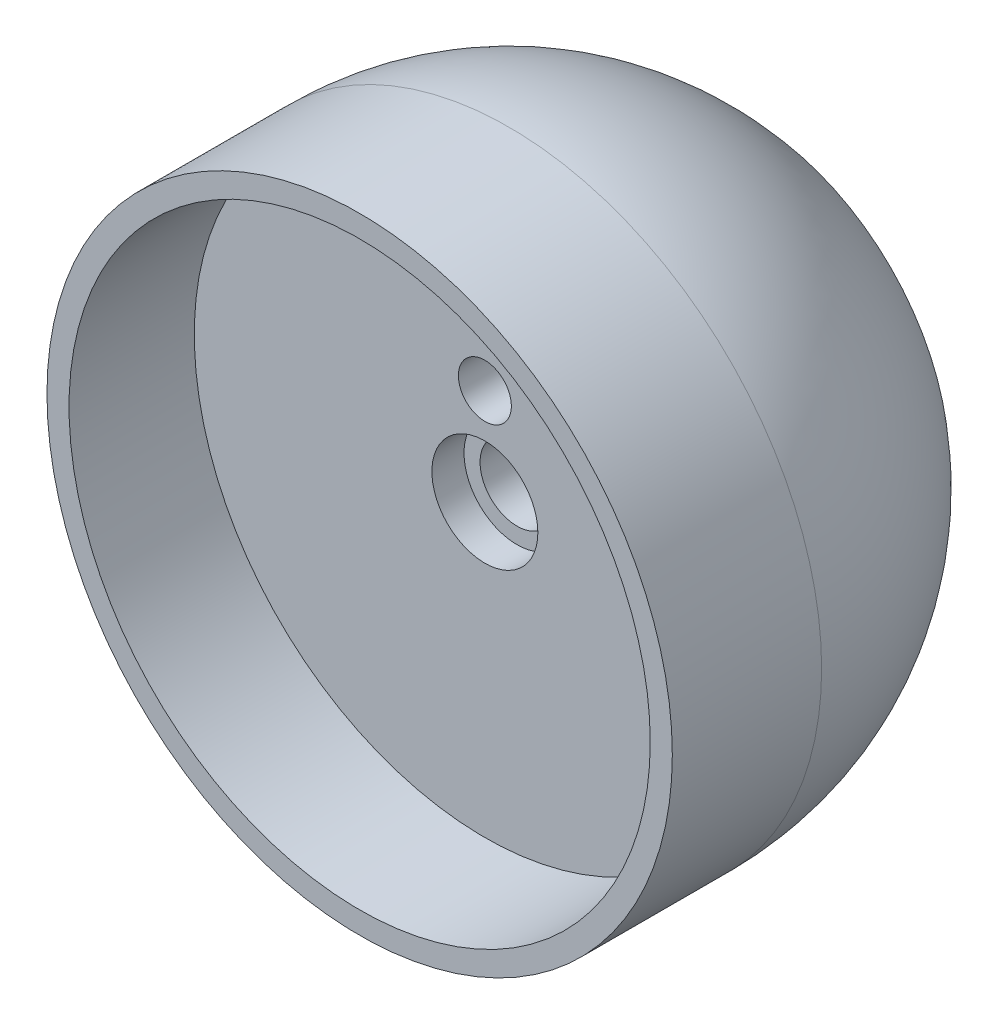
ISO-10303-21;
HEADER;
FILE_DESCRIPTION(('STEP AP214'),'2;1');
FILE_NAME('part.step','',(''),(''),'','','');
FILE_SCHEMA(('AUTOMOTIVE_DESIGN { 1 0 10303 214 1 1 1 1 }'));
ENDSEC;
DATA;
#1=APPLICATION_CONTEXT('core data for automotive mechanical design processes');
#2=APPLICATION_PROTOCOL_DEFINITION('international standard','automotive_design',2000,#1);
#3=PRODUCT_CONTEXT('',#1,'mechanical');
#4=PRODUCT('Part','Part','',(#3));
#5=PRODUCT_RELATED_PRODUCT_CATEGORY('part','',(#4));
#6=PRODUCT_DEFINITION_FORMATION('','',#4);
#7=PRODUCT_DEFINITION_CONTEXT('part definition',#1,'design');
#8=PRODUCT_DEFINITION('design','',#6,#7);
#9=PRODUCT_DEFINITION_SHAPE('','',#8);
#10=(LENGTH_UNIT() NAMED_UNIT(*) SI_UNIT(.MILLI.,.METRE.));
#11=(NAMED_UNIT(*) PLANE_ANGLE_UNIT() SI_UNIT($,.RADIAN.));
#12=(NAMED_UNIT(*) SI_UNIT($,.STERADIAN.) SOLID_ANGLE_UNIT());
#13=UNCERTAINTY_MEASURE_WITH_UNIT(LENGTH_MEASURE(1.E-05),#10,'distance_accuracy_value','');
#14=(GEOMETRIC_REPRESENTATION_CONTEXT(3) GLOBAL_UNCERTAINTY_ASSIGNED_CONTEXT((#13)) GLOBAL_UNIT_ASSIGNED_CONTEXT((#10,
#11,#12)) REPRESENTATION_CONTEXT('',''));
#15=CARTESIAN_POINT('',(0.,0.,0.));
#16=DIRECTION('',(0.,0.,1.));
#17=DIRECTION('',(1.,0.,0.));
#18=AXIS2_PLACEMENT_3D('',#15,#16,#17);
#19=CARTESIAN_POINT('',(0.,0.,-38.1));
#20=DIRECTION('',(0.,0.,1.));
#21=DIRECTION('',(1.,0.,0.));
#22=AXIS2_PLACEMENT_3D('',#19,#20,#21);
#23=CYLINDRICAL_SURFACE('',#22,5.842);
#24=CARTESIAN_POINT('',(0.,0.,-1.27));
#25=DIRECTION('',(0.,0.,1.));
#26=DIRECTION('',(1.,0.,0.));
#27=AXIS2_PLACEMENT_3D('',#24,#25,#26);
#28=CIRCLE('',#27,5.842);
#29=CARTESIAN_POINT('',(5.842,0.,-1.27));
#30=VERTEX_POINT('',#29);
#31=EDGE_CURVE('E67',#30,#30,#28,.T.);
#32=ORIENTED_EDGE('',*,*,#31,.T.);
#33=EDGE_LOOP('',(#32));
#34=FACE_BOUND('',#33,.T.);
#35=CARTESIAN_POINT('',(0.,0.,-33.02));
#36=DIRECTION('',(0.,0.,-1.));
#37=DIRECTION('',(-1.,0.,0.));
#38=AXIS2_PLACEMENT_3D('',#35,#36,#37);
#39=CIRCLE('',#38,5.842);
#40=CARTESIAN_POINT('',(-5.842,0.,-33.02));
#41=VERTEX_POINT('',#40);
#42=EDGE_CURVE('E41',#41,#41,#39,.F.);
#43=ORIENTED_EDGE('',*,*,#42,.F.);
#44=EDGE_LOOP('',(#43));
#45=FACE_BOUND('',#44,.T.);
#46=ADVANCED_FACE('F37',(#34,#45),#23,.F.);
#47=CARTESIAN_POINT('',(0.,0.,23.622));
#48=DIRECTION('',(0.,0.,-1.));
#49=DIRECTION('',(-1.,0.,0.));
#50=AXIS2_PLACEMENT_3D('',#47,#48,#49);
#51=CYLINDRICAL_SURFACE('',#50,49.4665);
#52=CARTESIAN_POINT('',(0.,0.,23.622));
#53=DIRECTION('',(0.,0.,1.));
#54=DIRECTION('',(1.,0.,0.));
#55=AXIS2_PLACEMENT_3D('',#52,#53,#54);
#56=CIRCLE('',#55,49.4665);
#57=CARTESIAN_POINT('',(49.4665,0.,23.622));
#58=VERTEX_POINT('',#57);
#59=EDGE_CURVE('E10',#58,#58,#56,.T.);
#60=ORIENTED_EDGE('',*,*,#59,.F.);
#61=EDGE_LOOP('',(#60));
#62=FACE_BOUND('',#61,.T.);
#63=CARTESIAN_POINT('',(0.,0.,0.));
#64=DIRECTION('',(0.,0.,1.));
#65=DIRECTION('',(1.,0.,0.));
#66=AXIS2_PLACEMENT_3D('',#63,#64,#65);
#67=CIRCLE('',#66,49.4665);
#68=CARTESIAN_POINT('',(49.4665,0.,0.));
#69=VERTEX_POINT('',#68);
#70=EDGE_CURVE('E55',#69,#69,#67,.T.);
#71=ORIENTED_EDGE('',*,*,#70,.T.);
#72=EDGE_LOOP('',(#71));
#73=FACE_BOUND('',#72,.T.);
#74=ADVANCED_FACE('F39',(#62,#73),#51,.T.);
#75=CARTESIAN_POINT('',(0.,0.,23.622));
#76=DIRECTION('',(0.,0.,1.));
#77=DIRECTION('',(1.,0.,0.));
#78=AXIS2_PLACEMENT_3D('',#75,#76,#77);
#79=PLANE('',#78);
#80=CARTESIAN_POINT('',(0.,0.,23.622));
#81=DIRECTION('',(0.,0.,1.));
#82=DIRECTION('',(1.,0.,0.));
#83=AXIS2_PLACEMENT_3D('',#80,#81,#82);
#84=CIRCLE('',#83,45.974);
#85=CARTESIAN_POINT('',(45.974,0.,23.622));
#86=VERTEX_POINT('',#85);
#87=EDGE_CURVE('E50',#86,#86,#84,.T.);
#88=ORIENTED_EDGE('',*,*,#87,.F.);
#89=EDGE_LOOP('',(#88));
#90=FACE_BOUND('',#89,.T.);
#91=ORIENTED_EDGE('',*,*,#59,.T.);
#92=EDGE_LOOP('',(#91));
#93=FACE_BOUND('',#92,.T.);
#94=ADVANCED_FACE('F96',(#90,#93),#79,.T.);
#95=CARTESIAN_POINT('',(0.,0.,3.81));
#96=DIRECTION('',(0.,0.,1.));
#97=DIRECTION('',(1.,0.,0.));
#98=AXIS2_PLACEMENT_3D('',#95,#96,#97);
#99=CYLINDRICAL_SURFACE('',#98,45.974);
#100=CARTESIAN_POINT('',(0.,0.,3.81));
#101=DIRECTION('',(0.,0.,1.));
#102=DIRECTION('',(1.,0.,0.));
#103=AXIS2_PLACEMENT_3D('',#100,#101,#102);
#104=CIRCLE('',#103,45.974);
#105=CARTESIAN_POINT('',(45.974,0.,3.81));
#106=VERTEX_POINT('',#105);
#107=EDGE_CURVE('E45',#106,#106,#104,.T.);
#108=ORIENTED_EDGE('',*,*,#107,.F.);
#109=EDGE_LOOP('',(#108));
#110=FACE_BOUND('',#109,.T.);
#111=ORIENTED_EDGE('',*,*,#87,.T.);
#112=EDGE_LOOP('',(#111));
#113=FACE_BOUND('',#112,.T.);
#114=ADVANCED_FACE('F120',(#110,#113),#99,.F.);
#115=CARTESIAN_POINT('',(0.,0.,3.81));
#116=DIRECTION('',(0.,0.,1.));
#117=DIRECTION('',(1.,0.,0.));
#118=AXIS2_PLACEMENT_3D('',#115,#116,#117);
#119=PLANE('',#118);
#120=CARTESIAN_POINT('',(0.,15.24,3.81));
#121=DIRECTION('',(0.,0.,1.));
#122=DIRECTION('',(1.,0.,0.));
#123=AXIS2_PLACEMENT_3D('',#120,#121,#122);
#124=CIRCLE('',#123,4.191);
#125=CARTESIAN_POINT('',(4.191,15.24,3.81));
#126=VERTEX_POINT('',#125);
#127=EDGE_CURVE('E73',#126,#126,#124,.T.);
#128=ORIENTED_EDGE('',*,*,#127,.F.);
#129=EDGE_LOOP('',(#128));
#130=FACE_BOUND('',#129,.T.);
#131=CARTESIAN_POINT('',(0.,0.,3.81));
#132=DIRECTION('',(0.,0.,1.));
#133=DIRECTION('',(1.,0.,0.));
#134=AXIS2_PLACEMENT_3D('',#131,#132,#133);
#135=CIRCLE('',#134,8.382);
#136=CARTESIAN_POINT('',(8.382,0.,3.81));
#137=VERTEX_POINT('',#136);
#138=EDGE_CURVE('E62',#137,#137,#135,.T.);
#139=ORIENTED_EDGE('',*,*,#138,.F.);
#140=EDGE_LOOP('',(#139));
#141=FACE_BOUND('',#140,.T.);
#142=ORIENTED_EDGE('',*,*,#107,.T.);
#143=EDGE_LOOP('',(#142));
#144=FACE_BOUND('',#143,.T.);
#145=ADVANCED_FACE('F117',(#130,#141,#144),#119,.T.);
#146=CARTESIAN_POINT('',(0.,0.,0.));
#147=DIRECTION('',(0.,0.,1.));
#148=DIRECTION('',(1.,0.,0.));
#149=AXIS2_PLACEMENT_3D('',#146,#147,#148);
#150=SPHERICAL_SURFACE('',#149,49.4665);
#151=CARTESIAN_POINT('',(0.,0.,-38.1));
#152=DIRECTION('',(0.,0.,1.));
#153=DIRECTION('',(1.,0.,0.));
#154=AXIS2_PLACEMENT_3D('',#151,#152,#153);
#155=CIRCLE('',#154,31.5487657801379);
#156=CARTESIAN_POINT('',(31.5487657801379,0.,-38.1));
#157=VERTEX_POINT('',#156);
#158=EDGE_CURVE('E53',#157,#157,#155,.T.);
#159=ORIENTED_EDGE('',*,*,#158,.T.);
#160=EDGE_LOOP('',(#159));
#161=FACE_BOUND('',#160,.T.);
#162=ORIENTED_EDGE('',*,*,#70,.F.);
#163=EDGE_LOOP('',(#162));
#164=FACE_BOUND('',#163,.T.);
#165=ADVANCED_FACE('F113',(#161,#164),#150,.T.);
#166=CARTESIAN_POINT('',(44.6512342198621,-49.4665,-38.1));
#167=DIRECTION('',(0.,0.,1.));
#168=DIRECTION('',(1.,0.,0.));
#169=AXIS2_PLACEMENT_3D('',#166,#167,#168);
#170=PLANE('',#169);
#171=CARTESIAN_POINT('',(0.,0.,-38.1));
#172=DIRECTION('',(0.,0.,1.));
#173=DIRECTION('',(1.,0.,0.));
#174=AXIS2_PLACEMENT_3D('',#171,#172,#173);
#175=CIRCLE('',#174,8.382);
#176=CARTESIAN_POINT('',(8.382,0.,-38.1));
#177=VERTEX_POINT('',#176);
#178=EDGE_CURVE('E78',#177,#177,#175,.T.);
#179=ORIENTED_EDGE('',*,*,#178,.T.);
#180=EDGE_LOOP('',(#179));
#181=FACE_BOUND('',#180,.T.);
#182=CARTESIAN_POINT('',(0.,15.24,-38.1));
#183=DIRECTION('',(0.,0.,1.));
#184=DIRECTION('',(1.,0.,0.));
#185=AXIS2_PLACEMENT_3D('',#182,#183,#184);
#186=CIRCLE('',#185,4.191);
#187=CARTESIAN_POINT('',(4.191,15.24,-38.1));
#188=VERTEX_POINT('',#187);
#189=EDGE_CURVE('E72',#188,#188,#186,.T.);
#190=ORIENTED_EDGE('',*,*,#189,.T.);
#191=EDGE_LOOP('',(#190));
#192=FACE_BOUND('',#191,.T.);
#193=ORIENTED_EDGE('',*,*,#158,.F.);
#194=EDGE_LOOP('',(#193));
#195=FACE_BOUND('',#194,.T.);
#196=ADVANCED_FACE('F109',(#181,#192,#195),#170,.F.);
#197=CARTESIAN_POINT('',(0.,0.,-1.27));
#198=DIRECTION('',(0.,0.,1.));
#199=DIRECTION('',(1.,0.,0.));
#200=AXIS2_PLACEMENT_3D('',#197,#198,#199);
#201=CYLINDRICAL_SURFACE('',#200,8.382);
#202=CARTESIAN_POINT('',(0.,0.,-1.27));
#203=DIRECTION('',(0.,0.,1.));
#204=DIRECTION('',(1.,0.,0.));
#205=AXIS2_PLACEMENT_3D('',#202,#203,#204);
#206=CIRCLE('',#205,8.382);
#207=CARTESIAN_POINT('',(8.382,0.,-1.27));
#208=VERTEX_POINT('',#207);
#209=EDGE_CURVE('E56',#208,#208,#206,.T.);
#210=ORIENTED_EDGE('',*,*,#209,.F.);
#211=EDGE_LOOP('',(#210));
#212=FACE_BOUND('',#211,.T.);
#213=ORIENTED_EDGE('',*,*,#138,.T.);
#214=EDGE_LOOP('',(#213));
#215=FACE_BOUND('',#214,.T.);
#216=ADVANCED_FACE('F105',(#212,#215),#201,.F.);
#217=CARTESIAN_POINT('',(0.,0.,-1.27));
#218=DIRECTION('',(0.,0.,1.));
#219=DIRECTION('',(1.,0.,0.));
#220=AXIS2_PLACEMENT_3D('',#217,#218,#219);
#221=PLANE('',#220);
#222=ORIENTED_EDGE('',*,*,#31,.F.);
#223=EDGE_LOOP('',(#222));
#224=FACE_BOUND('',#223,.T.);
#225=ORIENTED_EDGE('',*,*,#209,.T.);
#226=EDGE_LOOP('',(#225));
#227=FACE_BOUND('',#226,.T.);
#228=ADVANCED_FACE('F102',(#224,#227),#221,.T.);
#229=CARTESIAN_POINT('',(0.,15.24,-38.1));
#230=DIRECTION('',(0.,0.,1.));
#231=DIRECTION('',(1.,0.,0.));
#232=AXIS2_PLACEMENT_3D('',#229,#230,#231);
#233=CYLINDRICAL_SURFACE('',#232,4.191);
#234=ORIENTED_EDGE('',*,*,#189,.F.);
#235=EDGE_LOOP('',(#234));
#236=FACE_BOUND('',#235,.T.);
#237=ORIENTED_EDGE('',*,*,#127,.T.);
#238=EDGE_LOOP('',(#237));
#239=FACE_BOUND('',#238,.T.);
#240=ADVANCED_FACE('F100',(#236,#239),#233,.F.);
#241=CARTESIAN_POINT('',(0.,0.,-33.02));
#242=DIRECTION('',(0.,0.,-1.));
#243=DIRECTION('',(1.,0.,0.));
#244=AXIS2_PLACEMENT_3D('',#241,#242,#243);
#245=PLANE('',#244);
#246=CARTESIAN_POINT('',(0.,0.,-33.02));
#247=DIRECTION('',(0.,0.,1.));
#248=DIRECTION('',(1.,0.,0.));
#249=AXIS2_PLACEMENT_3D('',#246,#247,#248);
#250=CIRCLE('',#249,8.382);
#251=CARTESIAN_POINT('',(8.382,0.,-33.02));
#252=VERTEX_POINT('',#251);
#253=EDGE_CURVE('E81',#252,#252,#250,.T.);
#254=ORIENTED_EDGE('',*,*,#253,.F.);
#255=EDGE_LOOP('',(#254));
#256=FACE_BOUND('',#255,.T.);
#257=ORIENTED_EDGE('',*,*,#42,.T.);
#258=EDGE_LOOP('',(#257));
#259=FACE_BOUND('',#258,.T.);
#260=ADVANCED_FACE('F88',(#256,#259),#245,.T.);
#261=CARTESIAN_POINT('',(0.,0.,-33.02));
#262=DIRECTION('',(0.,0.,-1.));
#263=DIRECTION('',(-1.,0.,0.));
#264=AXIS2_PLACEMENT_3D('',#261,#262,#263);
#265=CYLINDRICAL_SURFACE('',#264,8.382);
#266=ORIENTED_EDGE('',*,*,#253,.T.);
#267=EDGE_LOOP('',(#266));
#268=FACE_BOUND('',#267,.T.);
#269=ORIENTED_EDGE('',*,*,#178,.F.);
#270=EDGE_LOOP('',(#269));
#271=FACE_BOUND('',#270,.T.);
#272=ADVANCED_FACE('F169',(#268,#271),#265,.F.);
#273=CLOSED_SHELL('',(#46,#74,#94,#114,#145,#165,#196,#216,#228,#240,#260,#272));
#274=MANIFOLD_SOLID_BREP('B2',#273);
#275=ADVANCED_BREP_SHAPE_REPRESENTATION('',(#18,#274),#14);
#276=SHAPE_DEFINITION_REPRESENTATION(#9,#275);
ENDSEC;
END-ISO-10303-21;
